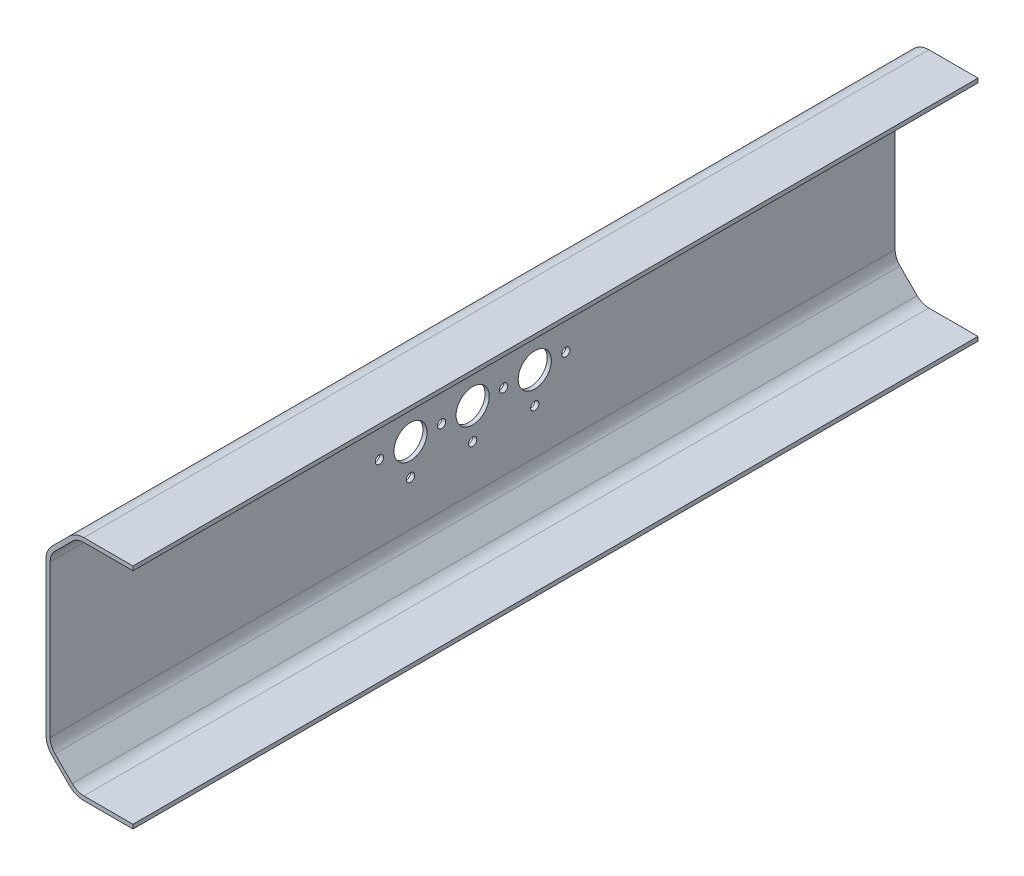
ISO-10303-21;
HEADER;
FILE_DESCRIPTION(('STEP AP214'),'2;1');
FILE_NAME('part.step','',(''),(''),'','','');
FILE_SCHEMA(('AUTOMOTIVE_DESIGN { 1 0 10303 214 1 1 1 1 }'));
ENDSEC;
DATA;
#1=APPLICATION_CONTEXT('core data for automotive mechanical design processes');
#2=APPLICATION_PROTOCOL_DEFINITION('international standard','automotive_design',2000,#1);
#3=PRODUCT_CONTEXT('',#1,'mechanical');
#4=PRODUCT('Part','Part','',(#3));
#5=PRODUCT_RELATED_PRODUCT_CATEGORY('part','',(#4));
#6=PRODUCT_DEFINITION_FORMATION('','',#4);
#7=PRODUCT_DEFINITION_CONTEXT('part definition',#1,'design');
#8=PRODUCT_DEFINITION('design','',#6,#7);
#9=PRODUCT_DEFINITION_SHAPE('','',#8);
#10=(LENGTH_UNIT() NAMED_UNIT(*) SI_UNIT(.MILLI.,.METRE.));
#11=(NAMED_UNIT(*) PLANE_ANGLE_UNIT() SI_UNIT($,.RADIAN.));
#12=(NAMED_UNIT(*) SI_UNIT($,.STERADIAN.) SOLID_ANGLE_UNIT());
#13=UNCERTAINTY_MEASURE_WITH_UNIT(LENGTH_MEASURE(1.E-05),#10,'distance_accuracy_value','');
#14=(GEOMETRIC_REPRESENTATION_CONTEXT(3) GLOBAL_UNCERTAINTY_ASSIGNED_CONTEXT((#13)) GLOBAL_UNIT_ASSIGNED_CONTEXT((#10,
#11,#12)) REPRESENTATION_CONTEXT('',''));
#15=CARTESIAN_POINT('',(0.,0.,0.));
#16=DIRECTION('',(0.,0.,1.));
#17=DIRECTION('',(1.,0.,0.));
#18=AXIS2_PLACEMENT_3D('',#15,#16,#17);
#19=CARTESIAN_POINT('',(13.9289321881345,55.,204.));
#20=DIRECTION('',(-1.,0.,0.));
#21=DIRECTION('',(0.,-1.,0.));
#22=AXIS2_PLACEMENT_3D('',#19,#20,#21);
#23=PLANE('',#22);
#24=DIRECTION('',(0.,1.,0.));
#25=VECTOR('',#24,1.);
#26=CARTESIAN_POINT('',(13.9289321881345,55.,0.));
#27=LINE('',#26,#25);
#28=CARTESIAN_POINT('',(13.9289321881345,54.,0.));
#29=VERTEX_POINT('',#28);
#30=CARTESIAN_POINT('',(13.9289321881345,55.,0.));
#31=VERTEX_POINT('',#30);
#32=EDGE_CURVE('E205',#29,#31,#27,.T.);
#33=ORIENTED_EDGE('',*,*,#32,.T.);
#34=DIRECTION('',(0.,0.,-1.));
#35=VECTOR('',#34,1.);
#36=CARTESIAN_POINT('',(13.9289321881345,55.,204.));
#37=LINE('',#36,#35);
#38=CARTESIAN_POINT('',(13.9289321881345,55.,204.));
#39=VERTEX_POINT('',#38);
#40=EDGE_CURVE('E11',#39,#31,#37,.T.);
#41=ORIENTED_EDGE('',*,*,#40,.F.);
#42=DIRECTION('',(0.,1.,0.));
#43=VECTOR('',#42,1.);
#44=CARTESIAN_POINT('',(13.9289321881345,55.,204.));
#45=LINE('',#44,#43);
#46=CARTESIAN_POINT('',(13.9289321881345,54.,204.));
#47=VERTEX_POINT('',#46);
#48=EDGE_CURVE('E243',#47,#39,#45,.T.);
#49=ORIENTED_EDGE('',*,*,#48,.F.);
#50=DIRECTION('',(0.,0.,-1.));
#51=VECTOR('',#50,1.);
#52=CARTESIAN_POINT('',(13.9289321881345,54.,204.));
#53=LINE('',#52,#51);
#54=EDGE_CURVE('E201',#47,#29,#53,.T.);
#55=ORIENTED_EDGE('',*,*,#54,.T.);
#56=EDGE_LOOP('',(#33,#41,#49,#55));
#57=FACE_BOUND('',#56,.T.);
#58=ADVANCED_FACE('F35',(#57),#23,.F.);
#59=CARTESIAN_POINT('',(2.07106781186545,55.,204.));
#60=DIRECTION('',(0.,-1.,0.));
#61=DIRECTION('',(0.,0.,-1.));
#62=AXIS2_PLACEMENT_3D('',#59,#60,#61);
#63=PLANE('',#62);
#64=DIRECTION('',(-1.,0.,0.));
#65=VECTOR('',#64,1.);
#66=CARTESIAN_POINT('',(2.07106781186545,55.,0.));
#67=LINE('',#66,#65);
#68=CARTESIAN_POINT('',(2.07106781186545,55.,0.));
#69=VERTEX_POINT('',#68);
#70=EDGE_CURVE('E208',#31,#69,#67,.T.);
#71=ORIENTED_EDGE('',*,*,#70,.T.);
#72=DIRECTION('',(0.,0.,-1.));
#73=VECTOR('',#72,1.);
#74=CARTESIAN_POINT('',(2.07106781186545,55.,204.));
#75=LINE('',#74,#73);
#76=CARTESIAN_POINT('',(2.07106781186545,55.,204.));
#77=VERTEX_POINT('',#76);
#78=EDGE_CURVE('E44',#77,#69,#75,.T.);
#79=ORIENTED_EDGE('',*,*,#78,.F.);
#80=DIRECTION('',(-1.,0.,0.));
#81=VECTOR('',#80,1.);
#82=CARTESIAN_POINT('',(2.07106781186545,55.,204.));
#83=LINE('',#82,#81);
#84=EDGE_CURVE('E132',#39,#77,#83,.T.);
#85=ORIENTED_EDGE('',*,*,#84,.F.);
#86=ORIENTED_EDGE('',*,*,#40,.T.);
#87=EDGE_LOOP('',(#71,#79,#85,#86));
#88=FACE_BOUND('',#87,.T.);
#89=ADVANCED_FACE('F347',(#88),#63,.F.);
#90=CARTESIAN_POINT('',(2.07106781186545,50.,204.));
#91=DIRECTION('',(0.,0.,-1.));
#92=DIRECTION('',(-1.,0.,0.));
#93=AXIS2_PLACEMENT_3D('',#90,#91,#92);
#94=CYLINDRICAL_SURFACE('',#93,5.);
#95=CARTESIAN_POINT('',(2.07106781186545,50.,0.));
#96=DIRECTION('',(0.,0.,1.));
#97=DIRECTION('',(-1.,0.,0.));
#98=AXIS2_PLACEMENT_3D('',#95,#96,#97);
#99=CIRCLE('',#98,5.);
#100=CARTESIAN_POINT('',(-1.46446609406728,53.5355339059328,0.));
#101=VERTEX_POINT('',#100);
#102=EDGE_CURVE('E210',#69,#101,#99,.T.);
#103=ORIENTED_EDGE('',*,*,#102,.T.);
#104=DIRECTION('',(0.,0.,-1.));
#105=VECTOR('',#104,1.);
#106=CARTESIAN_POINT('',(-1.46446609406728,53.5355339059328,204.));
#107=LINE('',#106,#105);
#108=CARTESIAN_POINT('',(-1.46446609406728,53.5355339059328,204.));
#109=VERTEX_POINT('',#108);
#110=EDGE_CURVE('E286',#109,#101,#107,.T.);
#111=ORIENTED_EDGE('',*,*,#110,.F.);
#112=CARTESIAN_POINT('',(2.07106781186545,50.,204.));
#113=DIRECTION('',(0.,0.,1.));
#114=DIRECTION('',(-1.,0.,0.));
#115=AXIS2_PLACEMENT_3D('',#112,#113,#114);
#116=CIRCLE('',#115,5.);
#117=EDGE_CURVE('E363',#77,#109,#116,.T.);
#118=ORIENTED_EDGE('',*,*,#117,.F.);
#119=ORIENTED_EDGE('',*,*,#78,.T.);
#120=EDGE_LOOP('',(#103,#111,#118,#119));
#121=FACE_BOUND('',#120,.T.);
#122=ADVANCED_FACE('F352',(#121),#94,.T.);
#123=CARTESIAN_POINT('',(-5.60660171779825,49.3933982822018,204.));
#124=DIRECTION('',(0.707106781186546,-0.707106781186549,0.));
#125=DIRECTION('',(0.707106781186549,0.707106781186546,0.));
#126=AXIS2_PLACEMENT_3D('',#123,#124,#125);
#127=PLANE('',#126);
#128=DIRECTION('',(-0.707106781186549,-0.707106781186546,0.));
#129=VECTOR('',#128,1.);
#130=CARTESIAN_POINT('',(-5.60660171779825,49.3933982822018,0.));
#131=LINE('',#130,#129);
#132=CARTESIAN_POINT('',(-5.60660171779825,49.3933982822018,0.));
#133=VERTEX_POINT('',#132);
#134=EDGE_CURVE('E212',#101,#133,#131,.T.);
#135=ORIENTED_EDGE('',*,*,#134,.T.);
#136=DIRECTION('',(0.,0.,-1.));
#137=VECTOR('',#136,1.);
#138=CARTESIAN_POINT('',(-5.60660171779825,49.3933982822018,204.));
#139=LINE('',#138,#137);
#140=CARTESIAN_POINT('',(-5.60660171779825,49.3933982822018,204.));
#141=VERTEX_POINT('',#140);
#142=EDGE_CURVE('E283',#141,#133,#139,.T.);
#143=ORIENTED_EDGE('',*,*,#142,.F.);
#144=DIRECTION('',(-0.707106781186549,-0.707106781186546,0.));
#145=VECTOR('',#144,1.);
#146=CARTESIAN_POINT('',(-5.60660171779825,49.3933982822018,204.));
#147=LINE('',#146,#145);
#148=EDGE_CURVE('E365',#109,#141,#147,.T.);
#149=ORIENTED_EDGE('',*,*,#148,.F.);
#150=ORIENTED_EDGE('',*,*,#110,.T.);
#151=EDGE_LOOP('',(#135,#143,#149,#150));
#152=FACE_BOUND('',#151,.T.);
#153=ADVANCED_FACE('F458',(#152),#127,.F.);
#154=CARTESIAN_POINT('',(-2.07106781186551,45.8578643762691,204.));
#155=DIRECTION('',(0.,0.,-1.));
#156=DIRECTION('',(-1.,0.,0.));
#157=AXIS2_PLACEMENT_3D('',#154,#155,#156);
#158=CYLINDRICAL_SURFACE('',#157,5.);
#159=CARTESIAN_POINT('',(-2.07106781186551,45.8578643762691,0.));
#160=DIRECTION('',(0.,0.,1.));
#161=DIRECTION('',(-1.,0.,0.));
#162=AXIS2_PLACEMENT_3D('',#159,#160,#161);
#163=CIRCLE('',#162,5.);
#164=CARTESIAN_POINT('',(-7.07106781186552,45.8578643762691,0.));
#165=VERTEX_POINT('',#164);
#166=EDGE_CURVE('E214',#133,#165,#163,.T.);
#167=ORIENTED_EDGE('',*,*,#166,.T.);
#168=DIRECTION('',(0.,0.,-1.));
#169=VECTOR('',#168,1.);
#170=CARTESIAN_POINT('',(-7.07106781186552,45.8578643762691,204.));
#171=LINE('',#170,#169);
#172=CARTESIAN_POINT('',(-7.07106781186552,45.8578643762691,204.));
#173=VERTEX_POINT('',#172);
#174=EDGE_CURVE('E280',#173,#165,#171,.T.);
#175=ORIENTED_EDGE('',*,*,#174,.F.);
#176=CARTESIAN_POINT('',(-2.07106781186551,45.8578643762691,204.));
#177=DIRECTION('',(0.,0.,1.));
#178=DIRECTION('',(-1.,0.,0.));
#179=AXIS2_PLACEMENT_3D('',#176,#177,#178);
#180=CIRCLE('',#179,5.);
#181=EDGE_CURVE('E367',#141,#173,#180,.T.);
#182=ORIENTED_EDGE('',*,*,#181,.F.);
#183=ORIENTED_EDGE('',*,*,#142,.T.);
#184=EDGE_LOOP('',(#167,#175,#182,#183));
#185=FACE_BOUND('',#184,.T.);
#186=ADVANCED_FACE('F455',(#185),#158,.T.);
#187=CARTESIAN_POINT('',(-7.07106781186551,9.14213562373095,204.));
#188=DIRECTION('',(1.,0.,0.));
#189=DIRECTION('',(0.,1.,0.));
#190=AXIS2_PLACEMENT_3D('',#187,#188,#189);
#191=PLANE('',#190);
#192=CARTESIAN_POINT('',(-7.07106781186551,27.4999999999999,87.));
#193=DIRECTION('',(-1.,0.,0.));
#194=DIRECTION('',(0.,0.,1.));
#195=AXIS2_PLACEMENT_3D('',#192,#193,#194);
#196=CIRCLE('',#195,4.00000000000001);
#197=CARTESIAN_POINT('',(-7.07106781186551,27.4999999999999,91.));
#198=VERTEX_POINT('',#197);
#199=EDGE_CURVE('E529',#198,#198,#196,.T.);
#200=ORIENTED_EDGE('',*,*,#199,.F.);
#201=EDGE_LOOP('',(#200));
#202=FACE_BOUND('',#201,.T.);
#203=CARTESIAN_POINT('',(-7.07106781186551,34.9999999999999,87.));
#204=DIRECTION('',(-1.,0.,0.));
#205=DIRECTION('',(0.,0.,1.));
#206=AXIS2_PLACEMENT_3D('',#203,#204,#205);
#207=CIRCLE('',#206,0.999999999999998);
#208=CARTESIAN_POINT('',(-7.07106781186551,34.9999999999999,88.));
#209=VERTEX_POINT('',#208);
#210=EDGE_CURVE('E526',#209,#209,#207,.T.);
#211=ORIENTED_EDGE('',*,*,#210,.F.);
#212=EDGE_LOOP('',(#211));
#213=FACE_BOUND('',#212,.T.);
#214=CARTESIAN_POINT('',(-7.07106781186551,19.9999999999999,87.));
#215=DIRECTION('',(-1.,0.,0.));
#216=DIRECTION('',(0.,0.,1.));
#217=AXIS2_PLACEMENT_3D('',#214,#215,#216);
#218=CIRCLE('',#217,0.999999999999998);
#219=CARTESIAN_POINT('',(-7.07106781186551,19.9999999999999,88.));
#220=VERTEX_POINT('',#219);
#221=EDGE_CURVE('E530',#220,#220,#218,.T.);
#222=ORIENTED_EDGE('',*,*,#221,.F.);
#223=EDGE_LOOP('',(#222));
#224=FACE_BOUND('',#223,.T.);
#225=CARTESIAN_POINT('',(-7.07106781186551,27.4999999999999,79.5));
#226=DIRECTION('',(-1.,0.,0.));
#227=DIRECTION('',(0.,0.,1.));
#228=AXIS2_PLACEMENT_3D('',#225,#226,#227);
#229=CIRCLE('',#228,0.999999999999998);
#230=CARTESIAN_POINT('',(-7.07106781186551,27.4999999999999,80.5));
#231=VERTEX_POINT('',#230);
#232=EDGE_CURVE('E533',#231,#231,#229,.T.);
#233=ORIENTED_EDGE('',*,*,#232,.F.);
#234=EDGE_LOOP('',(#233));
#235=FACE_BOUND('',#234,.T.);
#236=CARTESIAN_POINT('',(-7.07106781186551,20.,102.));
#237=DIRECTION('',(-1.,0.,0.));
#238=DIRECTION('',(0.,0.,1.));
#239=AXIS2_PLACEMENT_3D('',#236,#237,#238);
#240=CIRCLE('',#239,1.00000000000001);
#241=CARTESIAN_POINT('',(-7.07106781186551,20.,103.));
#242=VERTEX_POINT('',#241);
#243=EDGE_CURVE('E541',#242,#242,#240,.T.);
#244=ORIENTED_EDGE('',*,*,#243,.F.);
#245=EDGE_LOOP('',(#244));
#246=FACE_BOUND('',#245,.T.);
#247=CARTESIAN_POINT('',(-7.07106781186551,27.5,109.5));
#248=DIRECTION('',(-1.,0.,0.));
#249=DIRECTION('',(0.,0.,1.));
#250=AXIS2_PLACEMENT_3D('',#247,#248,#249);
#251=CIRCLE('',#250,0.999999999999998);
#252=CARTESIAN_POINT('',(-7.07106781186551,27.5,110.5));
#253=VERTEX_POINT('',#252);
#254=EDGE_CURVE('E539',#253,#253,#251,.T.);
#255=ORIENTED_EDGE('',*,*,#254,.F.);
#256=EDGE_LOOP('',(#255));
#257=FACE_BOUND('',#256,.T.);
#258=CARTESIAN_POINT('',(-7.07106781186551,27.5,117.));
#259=DIRECTION('',(-1.,0.,0.));
#260=DIRECTION('',(0.,0.,1.));
#261=AXIS2_PLACEMENT_3D('',#258,#259,#260);
#262=CIRCLE('',#261,4.00000000000001);
#263=CARTESIAN_POINT('',(-7.07106781186551,27.5,121.));
#264=VERTEX_POINT('',#263);
#265=EDGE_CURVE('E523',#264,#264,#262,.T.);
#266=ORIENTED_EDGE('',*,*,#265,.F.);
#267=EDGE_LOOP('',(#266));
#268=FACE_BOUND('',#267,.T.);
#269=CARTESIAN_POINT('',(-7.07106781186551,35.,102.));
#270=DIRECTION('',(-1.,0.,0.));
#271=DIRECTION('',(0.,0.,1.));
#272=AXIS2_PLACEMENT_3D('',#269,#270,#271);
#273=CIRCLE('',#272,0.999999999999998);
#274=CARTESIAN_POINT('',(-7.07106781186551,35.,103.));
#275=VERTEX_POINT('',#274);
#276=EDGE_CURVE('E520',#275,#275,#273,.T.);
#277=ORIENTED_EDGE('',*,*,#276,.F.);
#278=EDGE_LOOP('',(#277));
#279=FACE_BOUND('',#278,.T.);
#280=CARTESIAN_POINT('',(-7.07106781186551,20.,117.));
#281=DIRECTION('',(-1.,0.,0.));
#282=DIRECTION('',(0.,0.,1.));
#283=AXIS2_PLACEMENT_3D('',#280,#281,#282);
#284=CIRCLE('',#283,0.999999999999998);
#285=CARTESIAN_POINT('',(-7.07106781186551,20.,118.));
#286=VERTEX_POINT('',#285);
#287=EDGE_CURVE('E532',#286,#286,#284,.T.);
#288=ORIENTED_EDGE('',*,*,#287,.F.);
#289=EDGE_LOOP('',(#288));
#290=FACE_BOUND('',#289,.T.);
#291=CARTESIAN_POINT('',(-7.07106781186551,27.5,124.5));
#292=DIRECTION('',(-1.,0.,0.));
#293=DIRECTION('',(0.,0.,1.));
#294=AXIS2_PLACEMENT_3D('',#291,#292,#293);
#295=CIRCLE('',#294,0.999999999999984);
#296=CARTESIAN_POINT('',(-7.07106781186551,27.5,125.5));
#297=VERTEX_POINT('',#296);
#298=EDGE_CURVE('E550',#297,#297,#295,.T.);
#299=ORIENTED_EDGE('',*,*,#298,.F.);
#300=EDGE_LOOP('',(#299));
#301=FACE_BOUND('',#300,.T.);
#302=CARTESIAN_POINT('',(-7.07106781186551,35.,117.));
#303=DIRECTION('',(-1.,0.,0.));
#304=DIRECTION('',(0.,0.,1.));
#305=AXIS2_PLACEMENT_3D('',#302,#303,#304);
#306=CIRCLE('',#305,0.999999999999998);
#307=CARTESIAN_POINT('',(-7.07106781186551,35.,118.));
#308=VERTEX_POINT('',#307);
#309=EDGE_CURVE('E547',#308,#308,#306,.T.);
#310=ORIENTED_EDGE('',*,*,#309,.F.);
#311=EDGE_LOOP('',(#310));
#312=FACE_BOUND('',#311,.T.);
#313=CARTESIAN_POINT('',(-7.07106781186551,27.5,94.5));
#314=DIRECTION('',(-1.,0.,0.));
#315=DIRECTION('',(0.,0.,1.));
#316=AXIS2_PLACEMENT_3D('',#313,#314,#315);
#317=CIRCLE('',#316,0.999999999999998);
#318=CARTESIAN_POINT('',(-7.07106781186551,27.5,95.5));
#319=VERTEX_POINT('',#318);
#320=EDGE_CURVE('E544',#319,#319,#317,.T.);
#321=ORIENTED_EDGE('',*,*,#320,.F.);
#322=EDGE_LOOP('',(#321));
#323=FACE_BOUND('',#322,.T.);
#324=CARTESIAN_POINT('',(-7.07106781186551,27.5,102.));
#325=DIRECTION('',(-1.,0.,0.));
#326=DIRECTION('',(0.,0.,1.));
#327=AXIS2_PLACEMENT_3D('',#324,#325,#326);
#328=CIRCLE('',#327,4.00000000000001);
#329=CARTESIAN_POINT('',(-7.07106781186551,27.5,106.));
#330=VERTEX_POINT('',#329);
#331=EDGE_CURVE('E295',#330,#330,#328,.T.);
#332=ORIENTED_EDGE('',*,*,#331,.F.);
#333=EDGE_LOOP('',(#332));
#334=FACE_BOUND('',#333,.T.);
#335=DIRECTION('',(0.,-1.,0.));
#336=VECTOR('',#335,1.);
#337=CARTESIAN_POINT('',(-7.07106781186551,9.14213562373095,0.));
#338=LINE('',#337,#336);
#339=CARTESIAN_POINT('',(-7.07106781186551,9.14213562373095,0.));
#340=VERTEX_POINT('',#339);
#341=EDGE_CURVE('E216',#165,#340,#338,.T.);
#342=ORIENTED_EDGE('',*,*,#341,.T.);
#343=DIRECTION('',(0.,0.,-1.));
#344=VECTOR('',#343,1.);
#345=CARTESIAN_POINT('',(-7.07106781186551,9.14213562373095,204.));
#346=LINE('',#345,#344);
#347=CARTESIAN_POINT('',(-7.07106781186551,9.14213562373095,204.));
#348=VERTEX_POINT('',#347);
#349=EDGE_CURVE('E277',#348,#340,#346,.T.);
#350=ORIENTED_EDGE('',*,*,#349,.F.);
#351=DIRECTION('',(0.,-1.,0.));
#352=VECTOR('',#351,1.);
#353=CARTESIAN_POINT('',(-7.07106781186551,9.14213562373095,204.));
#354=LINE('',#353,#352);
#355=EDGE_CURVE('E373',#173,#348,#354,.T.);
#356=ORIENTED_EDGE('',*,*,#355,.F.);
#357=ORIENTED_EDGE('',*,*,#174,.T.);
#358=EDGE_LOOP('',(#342,#350,#356,#357));
#359=FACE_BOUND('',#358,.T.);
#360=ADVANCED_FACE('F450',(#202,#213,#224,#235,#246,#257,#268,#279,#290,#301,#312,#323,#334,
#359),#191,.F.);
#361=CARTESIAN_POINT('',(-2.07106781186554,9.14213562373094,204.));
#362=DIRECTION('',(0.,0.,-1.));
#363=DIRECTION('',(-1.,0.,0.));
#364=AXIS2_PLACEMENT_3D('',#361,#362,#363);
#365=CYLINDRICAL_SURFACE('',#364,4.99999999999999);
#366=CARTESIAN_POINT('',(-2.07106781186554,9.14213562373094,0.));
#367=DIRECTION('',(0.,0.,1.));
#368=DIRECTION('',(-1.,0.,0.));
#369=AXIS2_PLACEMENT_3D('',#366,#367,#368);
#370=CIRCLE('',#369,4.99999999999999);
#371=CARTESIAN_POINT('',(-5.60660171779825,5.60660171779819,0.));
#372=VERTEX_POINT('',#371);
#373=EDGE_CURVE('E218',#340,#372,#370,.T.);
#374=ORIENTED_EDGE('',*,*,#373,.T.);
#375=DIRECTION('',(0.,0.,-1.));
#376=VECTOR('',#375,1.);
#377=CARTESIAN_POINT('',(-5.60660171779825,5.60660171779819,204.));
#378=LINE('',#377,#376);
#379=CARTESIAN_POINT('',(-5.60660171779825,5.60660171779819,204.));
#380=VERTEX_POINT('',#379);
#381=EDGE_CURVE('E274',#380,#372,#378,.T.);
#382=ORIENTED_EDGE('',*,*,#381,.F.);
#383=CARTESIAN_POINT('',(-2.07106781186554,9.14213562373094,204.));
#384=DIRECTION('',(0.,0.,1.));
#385=DIRECTION('',(-1.,0.,0.));
#386=AXIS2_PLACEMENT_3D('',#383,#384,#385);
#387=CIRCLE('',#386,4.99999999999999);
#388=EDGE_CURVE('E375',#348,#380,#387,.T.);
#389=ORIENTED_EDGE('',*,*,#388,.F.);
#390=ORIENTED_EDGE('',*,*,#349,.T.);
#391=EDGE_LOOP('',(#374,#382,#389,#390));
#392=FACE_BOUND('',#391,.T.);
#393=ADVANCED_FACE('F445',(#392),#365,.T.);
#394=CARTESIAN_POINT('',(-1.46446609406727,1.46446609406724,204.));
#395=DIRECTION('',(0.707106781186544,0.707106781186552,0.));
#396=DIRECTION('',(-0.707106781186552,0.707106781186544,0.));
#397=AXIS2_PLACEMENT_3D('',#394,#395,#396);
#398=PLANE('',#397);
#399=DIRECTION('',(0.707106781186552,-0.707106781186544,0.));
#400=VECTOR('',#399,1.);
#401=CARTESIAN_POINT('',(-1.46446609406727,1.46446609406724,0.));
#402=LINE('',#401,#400);
#403=CARTESIAN_POINT('',(-1.46446609406727,1.46446609406724,0.));
#404=VERTEX_POINT('',#403);
#405=EDGE_CURVE('E220',#372,#404,#402,.T.);
#406=ORIENTED_EDGE('',*,*,#405,.T.);
#407=DIRECTION('',(0.,0.,-1.));
#408=VECTOR('',#407,1.);
#409=CARTESIAN_POINT('',(-1.46446609406727,1.46446609406724,204.));
#410=LINE('',#409,#408);
#411=CARTESIAN_POINT('',(-1.46446609406727,1.46446609406724,204.));
#412=VERTEX_POINT('',#411);
#413=EDGE_CURVE('E271',#412,#404,#410,.T.);
#414=ORIENTED_EDGE('',*,*,#413,.F.);
#415=DIRECTION('',(0.707106781186552,-0.707106781186544,0.));
#416=VECTOR('',#415,1.);
#417=CARTESIAN_POINT('',(-1.46446609406727,1.46446609406724,204.));
#418=LINE('',#417,#416);
#419=EDGE_CURVE('E377',#380,#412,#418,.T.);
#420=ORIENTED_EDGE('',*,*,#419,.F.);
#421=ORIENTED_EDGE('',*,*,#381,.T.);
#422=EDGE_LOOP('',(#406,#414,#420,#421));
#423=FACE_BOUND('',#422,.T.);
#424=ADVANCED_FACE('F441',(#423),#398,.F.);
#425=CARTESIAN_POINT('',(2.07106781186546,5.,204.));
#426=DIRECTION('',(0.,0.,-1.));
#427=DIRECTION('',(-1.,0.,0.));
#428=AXIS2_PLACEMENT_3D('',#425,#426,#427);
#429=CYLINDRICAL_SURFACE('',#428,5.00000000000001);
#430=CARTESIAN_POINT('',(2.07106781186546,5.,0.));
#431=DIRECTION('',(0.,0.,1.));
#432=DIRECTION('',(1.,0.,0.));
#433=AXIS2_PLACEMENT_3D('',#430,#431,#432);
#434=CIRCLE('',#433,5.00000000000001);
#435=CARTESIAN_POINT('',(2.07106781186544,0.,0.));
#436=VERTEX_POINT('',#435);
#437=EDGE_CURVE('E222',#404,#436,#434,.T.);
#438=ORIENTED_EDGE('',*,*,#437,.T.);
#439=DIRECTION('',(0.,0.,-1.));
#440=VECTOR('',#439,1.);
#441=CARTESIAN_POINT('',(2.07106781186544,0.,204.));
#442=LINE('',#441,#440);
#443=CARTESIAN_POINT('',(2.07106781186544,0.,204.));
#444=VERTEX_POINT('',#443);
#445=EDGE_CURVE('E268',#444,#436,#442,.T.);
#446=ORIENTED_EDGE('',*,*,#445,.F.);
#447=CARTESIAN_POINT('',(2.07106781186546,5.,204.));
#448=DIRECTION('',(0.,0.,1.));
#449=DIRECTION('',(1.,0.,0.));
#450=AXIS2_PLACEMENT_3D('',#447,#448,#449);
#451=CIRCLE('',#450,5.00000000000001);
#452=EDGE_CURVE('E379',#412,#444,#451,.T.);
#453=ORIENTED_EDGE('',*,*,#452,.F.);
#454=ORIENTED_EDGE('',*,*,#413,.T.);
#455=EDGE_LOOP('',(#438,#446,#453,#454));
#456=FACE_BOUND('',#455,.T.);
#457=ADVANCED_FACE('F436',(#456),#429,.T.);
#458=CARTESIAN_POINT('',(13.9289321881345,0.,204.));
#459=DIRECTION('',(0.,1.,0.));
#460=DIRECTION('',(-1.,0.,0.));
#461=AXIS2_PLACEMENT_3D('',#458,#459,#460);
#462=PLANE('',#461);
#463=DIRECTION('',(1.,0.,0.));
#464=VECTOR('',#463,1.);
#465=CARTESIAN_POINT('',(13.9289321881345,0.,0.));
#466=LINE('',#465,#464);
#467=CARTESIAN_POINT('',(13.9289321881345,0.,0.));
#468=VERTEX_POINT('',#467);
#469=EDGE_CURVE('E224',#436,#468,#466,.T.);
#470=ORIENTED_EDGE('',*,*,#469,.T.);
#471=DIRECTION('',(0.,0.,-1.));
#472=VECTOR('',#471,1.);
#473=CARTESIAN_POINT('',(13.9289321881345,0.,204.));
#474=LINE('',#473,#472);
#475=CARTESIAN_POINT('',(13.9289321881345,0.,204.));
#476=VERTEX_POINT('',#475);
#477=EDGE_CURVE('E265',#476,#468,#474,.T.);
#478=ORIENTED_EDGE('',*,*,#477,.F.);
#479=DIRECTION('',(1.,0.,0.));
#480=VECTOR('',#479,1.);
#481=CARTESIAN_POINT('',(13.9289321881345,0.,204.));
#482=LINE('',#481,#480);
#483=EDGE_CURVE('E381',#444,#476,#482,.T.);
#484=ORIENTED_EDGE('',*,*,#483,.F.);
#485=ORIENTED_EDGE('',*,*,#445,.T.);
#486=EDGE_LOOP('',(#470,#478,#484,#485));
#487=FACE_BOUND('',#486,.T.);
#488=ADVANCED_FACE('F430',(#487),#462,.F.);
#489=CARTESIAN_POINT('',(13.9289321881345,0.,204.));
#490=DIRECTION('',(-1.,0.,0.));
#491=DIRECTION('',(0.,0.,1.));
#492=AXIS2_PLACEMENT_3D('',#489,#490,#491);
#493=PLANE('',#492);
#494=DIRECTION('',(0.,1.,0.));
#495=VECTOR('',#494,1.);
#496=CARTESIAN_POINT('',(13.9289321881345,0.,0.));
#497=LINE('',#496,#495);
#498=CARTESIAN_POINT('',(13.9289321881345,1.,0.));
#499=VERTEX_POINT('',#498);
#500=EDGE_CURVE('E226',#468,#499,#497,.T.);
#501=ORIENTED_EDGE('',*,*,#500,.T.);
#502=DIRECTION('',(0.,0.,-1.));
#503=VECTOR('',#502,1.);
#504=CARTESIAN_POINT('',(13.9289321881345,1.,204.));
#505=LINE('',#504,#503);
#506=CARTESIAN_POINT('',(13.9289321881345,1.,204.));
#507=VERTEX_POINT('',#506);
#508=EDGE_CURVE('E262',#507,#499,#505,.T.);
#509=ORIENTED_EDGE('',*,*,#508,.F.);
#510=DIRECTION('',(0.,1.,0.));
#511=VECTOR('',#510,1.);
#512=CARTESIAN_POINT('',(13.9289321881345,0.,204.));
#513=LINE('',#512,#511);
#514=EDGE_CURVE('E383',#476,#507,#513,.T.);
#515=ORIENTED_EDGE('',*,*,#514,.F.);
#516=ORIENTED_EDGE('',*,*,#477,.T.);
#517=EDGE_LOOP('',(#501,#509,#515,#516));
#518=FACE_BOUND('',#517,.T.);
#519=ADVANCED_FACE('F426',(#518),#493,.F.);
#520=CARTESIAN_POINT('',(13.9289321881345,1.,204.));
#521=DIRECTION('',(0.,-1.,0.));
#522=DIRECTION('',(1.,0.,0.));
#523=AXIS2_PLACEMENT_3D('',#520,#521,#522);
#524=PLANE('',#523);
#525=DIRECTION('',(-1.,0.,0.));
#526=VECTOR('',#525,1.);
#527=CARTESIAN_POINT('',(13.9289321881345,1.,0.));
#528=LINE('',#527,#526);
#529=CARTESIAN_POINT('',(2.07106781186544,1.,0.));
#530=VERTEX_POINT('',#529);
#531=EDGE_CURVE('E228',#499,#530,#528,.T.);
#532=ORIENTED_EDGE('',*,*,#531,.T.);
#533=DIRECTION('',(0.,0.,-1.));
#534=VECTOR('',#533,1.);
#535=CARTESIAN_POINT('',(2.07106781186544,1.,204.));
#536=LINE('',#535,#534);
#537=CARTESIAN_POINT('',(2.07106781186544,1.,204.));
#538=VERTEX_POINT('',#537);
#539=EDGE_CURVE('E259',#538,#530,#536,.T.);
#540=ORIENTED_EDGE('',*,*,#539,.F.);
#541=DIRECTION('',(-1.,0.,0.));
#542=VECTOR('',#541,1.);
#543=CARTESIAN_POINT('',(13.9289321881345,1.,204.));
#544=LINE('',#543,#542);
#545=EDGE_CURVE('E385',#507,#538,#544,.T.);
#546=ORIENTED_EDGE('',*,*,#545,.F.);
#547=ORIENTED_EDGE('',*,*,#508,.T.);
#548=EDGE_LOOP('',(#532,#540,#546,#547));
#549=FACE_BOUND('',#548,.T.);
#550=ADVANCED_FACE('F421',(#549),#524,.F.);
#551=CARTESIAN_POINT('',(2.07106781186544,5.,204.));
#552=DIRECTION('',(0.,0.,-1.));
#553=DIRECTION('',(-1.,0.,0.));
#554=AXIS2_PLACEMENT_3D('',#551,#552,#553);
#555=CYLINDRICAL_SURFACE('',#554,4.);
#556=CARTESIAN_POINT('',(2.07106781186544,5.,0.));
#557=DIRECTION('',(0.,0.,-1.));
#558=DIRECTION('',(1.,0.,0.));
#559=AXIS2_PLACEMENT_3D('',#556,#557,#558);
#560=CIRCLE('',#559,4.);
#561=CARTESIAN_POINT('',(-0.75735931288073,2.17157287525379,0.));
#562=VERTEX_POINT('',#561);
#563=EDGE_CURVE('E230',#530,#562,#560,.T.);
#564=ORIENTED_EDGE('',*,*,#563,.T.);
#565=DIRECTION('',(0.,0.,-1.));
#566=VECTOR('',#565,1.);
#567=CARTESIAN_POINT('',(-0.75735931288073,2.17157287525379,204.));
#568=LINE('',#567,#566);
#569=CARTESIAN_POINT('',(-0.75735931288073,2.17157287525379,204.));
#570=VERTEX_POINT('',#569);
#571=EDGE_CURVE('E256',#570,#562,#568,.T.);
#572=ORIENTED_EDGE('',*,*,#571,.F.);
#573=CARTESIAN_POINT('',(2.07106781186544,5.,204.));
#574=DIRECTION('',(0.,0.,-1.));
#575=DIRECTION('',(1.,0.,0.));
#576=AXIS2_PLACEMENT_3D('',#573,#574,#575);
#577=CIRCLE('',#576,4.);
#578=EDGE_CURVE('E387',#538,#570,#577,.T.);
#579=ORIENTED_EDGE('',*,*,#578,.F.);
#580=ORIENTED_EDGE('',*,*,#539,.T.);
#581=EDGE_LOOP('',(#564,#572,#579,#580));
#582=FACE_BOUND('',#581,.T.);
#583=ADVANCED_FACE('F415',(#582),#555,.F.);
#584=CARTESIAN_POINT('',(-0.75735931288073,2.17157287525379,204.));
#585=DIRECTION('',(-0.707106781186544,-0.707106781186551,0.));
#586=DIRECTION('',(0.707106781186551,-0.707106781186544,0.));
#587=AXIS2_PLACEMENT_3D('',#584,#585,#586);
#588=PLANE('',#587);
#589=DIRECTION('',(-0.707106781186551,0.707106781186544,0.));
#590=VECTOR('',#589,1.);
#591=CARTESIAN_POINT('',(-0.75735931288073,2.17157287525379,0.));
#592=LINE('',#591,#590);
#593=CARTESIAN_POINT('',(-4.89949493661172,6.31370849898473,0.));
#594=VERTEX_POINT('',#593);
#595=EDGE_CURVE('E232',#562,#594,#592,.T.);
#596=ORIENTED_EDGE('',*,*,#595,.T.);
#597=DIRECTION('',(0.,0.,-1.));
#598=VECTOR('',#597,1.);
#599=CARTESIAN_POINT('',(-4.89949493661172,6.31370849898473,204.));
#600=LINE('',#599,#598);
#601=CARTESIAN_POINT('',(-4.89949493661172,6.31370849898473,204.));
#602=VERTEX_POINT('',#601);
#603=EDGE_CURVE('E253',#602,#594,#600,.T.);
#604=ORIENTED_EDGE('',*,*,#603,.F.);
#605=DIRECTION('',(-0.707106781186551,0.707106781186544,0.));
#606=VECTOR('',#605,1.);
#607=CARTESIAN_POINT('',(-0.75735931288073,2.17157287525379,204.));
#608=LINE('',#607,#606);
#609=EDGE_CURVE('E389',#570,#602,#608,.T.);
#610=ORIENTED_EDGE('',*,*,#609,.F.);
#611=ORIENTED_EDGE('',*,*,#571,.T.);
#612=EDGE_LOOP('',(#596,#604,#610,#611));
#613=FACE_BOUND('',#612,.T.);
#614=ADVANCED_FACE('F411',(#613),#588,.F.);
#615=CARTESIAN_POINT('',(-2.07106781186551,9.14213562373093,204.));
#616=DIRECTION('',(0.,0.,-1.));
#617=DIRECTION('',(-1.,0.,0.));
#618=AXIS2_PLACEMENT_3D('',#615,#616,#617);
#619=CYLINDRICAL_SURFACE('',#618,4.00000000000001);
#620=CARTESIAN_POINT('',(-2.07106781186551,9.14213562373093,0.));
#621=DIRECTION('',(0.,0.,-1.));
#622=DIRECTION('',(-1.,0.,0.));
#623=AXIS2_PLACEMENT_3D('',#620,#621,#622);
#624=CIRCLE('',#623,4.00000000000001);
#625=CARTESIAN_POINT('',(-6.07106781186552,9.14213562373093,0.));
#626=VERTEX_POINT('',#625);
#627=EDGE_CURVE('E234',#594,#626,#624,.T.);
#628=ORIENTED_EDGE('',*,*,#627,.T.);
#629=DIRECTION('',(0.,0.,-1.));
#630=VECTOR('',#629,1.);
#631=CARTESIAN_POINT('',(-6.07106781186552,9.14213562373093,204.));
#632=LINE('',#631,#630);
#633=CARTESIAN_POINT('',(-6.07106781186552,9.14213562373093,204.));
#634=VERTEX_POINT('',#633);
#635=EDGE_CURVE('E250',#634,#626,#632,.T.);
#636=ORIENTED_EDGE('',*,*,#635,.F.);
#637=CARTESIAN_POINT('',(-2.07106781186551,9.14213562373093,204.));
#638=DIRECTION('',(0.,0.,-1.));
#639=DIRECTION('',(-1.,0.,0.));
#640=AXIS2_PLACEMENT_3D('',#637,#638,#639);
#641=CIRCLE('',#640,4.00000000000001);
#642=EDGE_CURVE('E391',#602,#634,#641,.T.);
#643=ORIENTED_EDGE('',*,*,#642,.F.);
#644=ORIENTED_EDGE('',*,*,#603,.T.);
#645=EDGE_LOOP('',(#628,#636,#643,#644));
#646=FACE_BOUND('',#645,.T.);
#647=ADVANCED_FACE('F407',(#646),#619,.F.);
#648=CARTESIAN_POINT('',(-6.07106781186551,9.14213562373094,204.));
#649=DIRECTION('',(-1.,0.,0.));
#650=DIRECTION('',(0.,-1.,0.));
#651=AXIS2_PLACEMENT_3D('',#648,#649,#650);
#652=PLANE('',#651);
#653=CARTESIAN_POINT('',(-6.07106781186552,27.4999999999999,87.));
#654=DIRECTION('',(-1.,0.,0.));
#655=DIRECTION('',(0.,-1.,0.));
#656=AXIS2_PLACEMENT_3D('',#653,#654,#655);
#657=CIRCLE('',#656,4.00000000000001);
#658=CARTESIAN_POINT('',(-6.07106781186552,23.4999999999999,87.));
#659=VERTEX_POINT('',#658);
#660=EDGE_CURVE('E38',#659,#659,#657,.T.);
#661=ORIENTED_EDGE('',*,*,#660,.T.);
#662=EDGE_LOOP('',(#661));
#663=FACE_BOUND('',#662,.T.);
#664=CARTESIAN_POINT('',(-6.07106781186552,34.9999999999999,87.));
#665=DIRECTION('',(-1.,0.,0.));
#666=DIRECTION('',(0.,-1.,0.));
#667=AXIS2_PLACEMENT_3D('',#664,#665,#666);
#668=CIRCLE('',#667,0.999999999999998);
#669=CARTESIAN_POINT('',(-6.07106781186552,33.9999999999999,87.));
#670=VERTEX_POINT('',#669);
#671=EDGE_CURVE('E324',#670,#670,#668,.T.);
#672=ORIENTED_EDGE('',*,*,#671,.T.);
#673=EDGE_LOOP('',(#672));
#674=FACE_BOUND('',#673,.T.);
#675=CARTESIAN_POINT('',(-6.07106781186552,19.9999999999999,87.));
#676=DIRECTION('',(-1.,0.,0.));
#677=DIRECTION('',(0.,-1.,0.));
#678=AXIS2_PLACEMENT_3D('',#675,#676,#677);
#679=CIRCLE('',#678,0.999999999999998);
#680=CARTESIAN_POINT('',(-6.07106781186552,18.9999999999999,87.));
#681=VERTEX_POINT('',#680);
#682=EDGE_CURVE('E322',#681,#681,#679,.T.);
#683=ORIENTED_EDGE('',*,*,#682,.T.);
#684=EDGE_LOOP('',(#683));
#685=FACE_BOUND('',#684,.T.);
#686=CARTESIAN_POINT('',(-6.07106781186552,27.4999999999999,79.5));
#687=DIRECTION('',(-1.,0.,0.));
#688=DIRECTION('',(0.,-1.,0.));
#689=AXIS2_PLACEMENT_3D('',#686,#687,#688);
#690=CIRCLE('',#689,0.999999999999998);
#691=CARTESIAN_POINT('',(-6.07106781186552,26.4999999999999,79.5));
#692=VERTEX_POINT('',#691);
#693=EDGE_CURVE('E319',#692,#692,#690,.T.);
#694=ORIENTED_EDGE('',*,*,#693,.T.);
#695=EDGE_LOOP('',(#694));
#696=FACE_BOUND('',#695,.T.);
#697=CARTESIAN_POINT('',(-6.07106781186552,20.,102.));
#698=DIRECTION('',(-1.,0.,0.));
#699=DIRECTION('',(0.,-1.,0.));
#700=AXIS2_PLACEMENT_3D('',#697,#698,#699);
#701=CIRCLE('',#700,1.00000000000001);
#702=CARTESIAN_POINT('',(-6.07106781186552,19.,102.));
#703=VERTEX_POINT('',#702);
#704=EDGE_CURVE('E316',#703,#703,#701,.T.);
#705=ORIENTED_EDGE('',*,*,#704,.T.);
#706=EDGE_LOOP('',(#705));
#707=FACE_BOUND('',#706,.T.);
#708=CARTESIAN_POINT('',(-6.07106781186552,27.5,109.5));
#709=DIRECTION('',(-1.,0.,0.));
#710=DIRECTION('',(0.,-1.,0.));
#711=AXIS2_PLACEMENT_3D('',#708,#709,#710);
#712=CIRCLE('',#711,0.999999999999998);
#713=CARTESIAN_POINT('',(-6.07106781186552,26.5,109.5));
#714=VERTEX_POINT('',#713);
#715=EDGE_CURVE('E313',#714,#714,#712,.T.);
#716=ORIENTED_EDGE('',*,*,#715,.T.);
#717=EDGE_LOOP('',(#716));
#718=FACE_BOUND('',#717,.T.);
#719=CARTESIAN_POINT('',(-6.07106781186552,27.5,117.));
#720=DIRECTION('',(-1.,0.,0.));
#721=DIRECTION('',(0.,-1.,0.));
#722=AXIS2_PLACEMENT_3D('',#719,#720,#721);
#723=CIRCLE('',#722,4.00000000000001);
#724=CARTESIAN_POINT('',(-6.07106781186552,23.5,117.));
#725=VERTEX_POINT('',#724);
#726=EDGE_CURVE('E310',#725,#725,#723,.T.);
#727=ORIENTED_EDGE('',*,*,#726,.T.);
#728=EDGE_LOOP('',(#727));
#729=FACE_BOUND('',#728,.T.);
#730=CARTESIAN_POINT('',(-6.07106781186552,35.,102.));
#731=DIRECTION('',(-1.,0.,0.));
#732=DIRECTION('',(0.,-1.,0.));
#733=AXIS2_PLACEMENT_3D('',#730,#731,#732);
#734=CIRCLE('',#733,0.999999999999998);
#735=CARTESIAN_POINT('',(-6.07106781186552,34.,102.));
#736=VERTEX_POINT('',#735);
#737=EDGE_CURVE('E307',#736,#736,#734,.T.);
#738=ORIENTED_EDGE('',*,*,#737,.T.);
#739=EDGE_LOOP('',(#738));
#740=FACE_BOUND('',#739,.T.);
#741=CARTESIAN_POINT('',(-6.07106781186552,20.,117.));
#742=DIRECTION('',(-1.,0.,0.));
#743=DIRECTION('',(0.,-1.,0.));
#744=AXIS2_PLACEMENT_3D('',#741,#742,#743);
#745=CIRCLE('',#744,0.999999999999998);
#746=CARTESIAN_POINT('',(-6.07106781186552,19.,117.));
#747=VERTEX_POINT('',#746);
#748=EDGE_CURVE('E304',#747,#747,#745,.T.);
#749=ORIENTED_EDGE('',*,*,#748,.T.);
#750=EDGE_LOOP('',(#749));
#751=FACE_BOUND('',#750,.T.);
#752=CARTESIAN_POINT('',(-6.07106781186552,27.5,124.5));
#753=DIRECTION('',(-1.,0.,0.));
#754=DIRECTION('',(0.,-1.,0.));
#755=AXIS2_PLACEMENT_3D('',#752,#753,#754);
#756=CIRCLE('',#755,0.999999999999984);
#757=CARTESIAN_POINT('',(-6.07106781186552,26.5,124.5));
#758=VERTEX_POINT('',#757);
#759=EDGE_CURVE('E301',#758,#758,#756,.T.);
#760=ORIENTED_EDGE('',*,*,#759,.T.);
#761=EDGE_LOOP('',(#760));
#762=FACE_BOUND('',#761,.T.);
#763=CARTESIAN_POINT('',(-6.07106781186552,35.,117.));
#764=DIRECTION('',(-1.,0.,0.));
#765=DIRECTION('',(0.,-1.,0.));
#766=AXIS2_PLACEMENT_3D('',#763,#764,#765);
#767=CIRCLE('',#766,0.999999999999998);
#768=CARTESIAN_POINT('',(-6.07106781186552,34.,117.));
#769=VERTEX_POINT('',#768);
#770=EDGE_CURVE('E298',#769,#769,#767,.T.);
#771=ORIENTED_EDGE('',*,*,#770,.T.);
#772=EDGE_LOOP('',(#771));
#773=FACE_BOUND('',#772,.T.);
#774=CARTESIAN_POINT('',(-6.07106781186552,27.5,94.5));
#775=DIRECTION('',(-1.,0.,0.));
#776=DIRECTION('',(0.,-1.,0.));
#777=AXIS2_PLACEMENT_3D('',#774,#775,#776);
#778=CIRCLE('',#777,0.999999999999998);
#779=CARTESIAN_POINT('',(-6.07106781186552,26.5,94.5));
#780=VERTEX_POINT('',#779);
#781=EDGE_CURVE('E294',#780,#780,#778,.T.);
#782=ORIENTED_EDGE('',*,*,#781,.T.);
#783=EDGE_LOOP('',(#782));
#784=FACE_BOUND('',#783,.T.);
#785=CARTESIAN_POINT('',(-6.07106781186552,27.5,102.));
#786=DIRECTION('',(-1.,0.,0.));
#787=DIRECTION('',(0.,-1.,0.));
#788=AXIS2_PLACEMENT_3D('',#785,#786,#787);
#789=CIRCLE('',#788,4.00000000000001);
#790=CARTESIAN_POINT('',(-6.07106781186552,23.5,102.));
#791=VERTEX_POINT('',#790);
#792=EDGE_CURVE('E291',#791,#791,#789,.T.);
#793=ORIENTED_EDGE('',*,*,#792,.T.);
#794=EDGE_LOOP('',(#793));
#795=FACE_BOUND('',#794,.T.);
#796=DIRECTION('',(0.,1.,0.));
#797=VECTOR('',#796,1.);
#798=CARTESIAN_POINT('',(-6.07106781186551,9.14213562373094,0.));
#799=LINE('',#798,#797);
#800=CARTESIAN_POINT('',(-6.07106781186551,45.8578643762691,0.));
#801=VERTEX_POINT('',#800);
#802=EDGE_CURVE('E236',#626,#801,#799,.T.);
#803=ORIENTED_EDGE('',*,*,#802,.T.);
#804=DIRECTION('',(0.,0.,-1.));
#805=VECTOR('',#804,1.);
#806=CARTESIAN_POINT('',(-6.07106781186551,45.8578643762691,204.));
#807=LINE('',#806,#805);
#808=CARTESIAN_POINT('',(-6.07106781186551,45.8578643762691,204.));
#809=VERTEX_POINT('',#808);
#810=EDGE_CURVE('E247',#809,#801,#807,.T.);
#811=ORIENTED_EDGE('',*,*,#810,.F.);
#812=DIRECTION('',(0.,1.,0.));
#813=VECTOR('',#812,1.);
#814=CARTESIAN_POINT('',(-6.07106781186551,9.14213562373094,204.));
#815=LINE('',#814,#813);
#816=EDGE_CURVE('E393',#634,#809,#815,.T.);
#817=ORIENTED_EDGE('',*,*,#816,.F.);
#818=ORIENTED_EDGE('',*,*,#635,.T.);
#819=EDGE_LOOP('',(#803,#811,#817,#818));
#820=FACE_BOUND('',#819,.T.);
#821=ADVANCED_FACE('F331',(#663,#674,#685,#696,#707,#718,#729,#740,#751,#762,#773,#784,#795,
#820),#652,.F.);
#822=CARTESIAN_POINT('',(-2.07106781186551,45.8578643762691,204.));
#823=DIRECTION('',(0.,0.,-1.));
#824=DIRECTION('',(-1.,0.,0.));
#825=AXIS2_PLACEMENT_3D('',#822,#823,#824);
#826=CYLINDRICAL_SURFACE('',#825,4.);
#827=CARTESIAN_POINT('',(-2.07106781186551,45.8578643762691,0.));
#828=DIRECTION('',(0.,0.,-1.));
#829=DIRECTION('',(-1.,0.,0.));
#830=AXIS2_PLACEMENT_3D('',#827,#828,#829);
#831=CIRCLE('',#830,4.);
#832=CARTESIAN_POINT('',(-4.8994949366117,48.6862915010152,0.));
#833=VERTEX_POINT('',#832);
#834=EDGE_CURVE('E238',#801,#833,#831,.T.);
#835=ORIENTED_EDGE('',*,*,#834,.T.);
#836=DIRECTION('',(0.,0.,-1.));
#837=VECTOR('',#836,1.);
#838=CARTESIAN_POINT('',(-4.8994949366117,48.6862915010152,204.));
#839=LINE('',#838,#837);
#840=CARTESIAN_POINT('',(-4.8994949366117,48.6862915010152,204.));
#841=VERTEX_POINT('',#840);
#842=EDGE_CURVE('E196',#841,#833,#839,.T.);
#843=ORIENTED_EDGE('',*,*,#842,.F.);
#844=CARTESIAN_POINT('',(-2.07106781186551,45.8578643762691,204.));
#845=DIRECTION('',(0.,0.,-1.));
#846=DIRECTION('',(-1.,0.,0.));
#847=AXIS2_PLACEMENT_3D('',#844,#845,#846);
#848=CIRCLE('',#847,4.);
#849=EDGE_CURVE('E187',#809,#841,#848,.T.);
#850=ORIENTED_EDGE('',*,*,#849,.F.);
#851=ORIENTED_EDGE('',*,*,#810,.T.);
#852=EDGE_LOOP('',(#835,#843,#850,#851));
#853=FACE_BOUND('',#852,.T.);
#854=ADVANCED_FACE('F402',(#853),#826,.F.);
#855=CARTESIAN_POINT('',(-4.8994949366117,48.6862915010152,204.));
#856=DIRECTION('',(-0.707106781186546,0.707106781186549,0.));
#857=DIRECTION('',(-0.707106781186549,-0.707106781186546,0.));
#858=AXIS2_PLACEMENT_3D('',#855,#856,#857);
#859=PLANE('',#858);
#860=DIRECTION('',(0.707106781186549,0.707106781186546,0.));
#861=VECTOR('',#860,1.);
#862=CARTESIAN_POINT('',(-4.8994949366117,48.6862915010152,0.));
#863=LINE('',#862,#861);
#864=CARTESIAN_POINT('',(-0.757359312880736,52.8284271247462,0.));
#865=VERTEX_POINT('',#864);
#866=EDGE_CURVE('E195',#833,#865,#863,.T.);
#867=ORIENTED_EDGE('',*,*,#866,.T.);
#868=DIRECTION('',(0.,0.,-1.));
#869=VECTOR('',#868,1.);
#870=CARTESIAN_POINT('',(-0.757359312880736,52.8284271247462,204.));
#871=LINE('',#870,#869);
#872=CARTESIAN_POINT('',(-0.757359312880736,52.8284271247462,204.));
#873=VERTEX_POINT('',#872);
#874=EDGE_CURVE('E192',#873,#865,#871,.T.);
#875=ORIENTED_EDGE('',*,*,#874,.F.);
#876=DIRECTION('',(0.707106781186549,0.707106781186546,0.));
#877=VECTOR('',#876,1.);
#878=CARTESIAN_POINT('',(-4.8994949366117,48.6862915010152,204.));
#879=LINE('',#878,#877);
#880=EDGE_CURVE('E181',#841,#873,#879,.T.);
#881=ORIENTED_EDGE('',*,*,#880,.F.);
#882=ORIENTED_EDGE('',*,*,#842,.T.);
#883=EDGE_LOOP('',(#867,#875,#881,#882));
#884=FACE_BOUND('',#883,.T.);
#885=ADVANCED_FACE('F193',(#884),#859,.F.);
#886=CARTESIAN_POINT('',(2.07106781186545,50.,204.));
#887=DIRECTION('',(0.,0.,-1.));
#888=DIRECTION('',(-1.,0.,0.));
#889=AXIS2_PLACEMENT_3D('',#886,#887,#888);
#890=CYLINDRICAL_SURFACE('',#889,4.);
#891=CARTESIAN_POINT('',(2.07106781186545,50.,0.));
#892=DIRECTION('',(0.,0.,-1.));
#893=DIRECTION('',(-1.,0.,0.));
#894=AXIS2_PLACEMENT_3D('',#891,#892,#893);
#895=CIRCLE('',#894,4.);
#896=CARTESIAN_POINT('',(2.07106781186545,54.,0.));
#897=VERTEX_POINT('',#896);
#898=EDGE_CURVE('E118',#865,#897,#895,.T.);
#899=ORIENTED_EDGE('',*,*,#898,.T.);
#900=DIRECTION('',(0.,0.,-1.));
#901=VECTOR('',#900,1.);
#902=CARTESIAN_POINT('',(2.07106781186545,54.,204.));
#903=LINE('',#902,#901);
#904=CARTESIAN_POINT('',(2.07106781186545,54.,204.));
#905=VERTEX_POINT('',#904);
#906=EDGE_CURVE('E197',#905,#897,#903,.T.);
#907=ORIENTED_EDGE('',*,*,#906,.F.);
#908=CARTESIAN_POINT('',(2.07106781186545,50.,204.));
#909=DIRECTION('',(0.,0.,-1.));
#910=DIRECTION('',(-1.,0.,0.));
#911=AXIS2_PLACEMENT_3D('',#908,#909,#910);
#912=CIRCLE('',#911,4.);
#913=EDGE_CURVE('E185',#873,#905,#912,.T.);
#914=ORIENTED_EDGE('',*,*,#913,.F.);
#915=ORIENTED_EDGE('',*,*,#874,.T.);
#916=EDGE_LOOP('',(#899,#907,#914,#915));
#917=FACE_BOUND('',#916,.T.);
#918=ADVANCED_FACE('F199',(#917),#890,.F.);
#919=CARTESIAN_POINT('',(2.07106781186545,54.,204.));
#920=DIRECTION('',(0.,1.,0.));
#921=DIRECTION('',(0.,0.,1.));
#922=AXIS2_PLACEMENT_3D('',#919,#920,#921);
#923=PLANE('',#922);
#924=DIRECTION('',(1.,0.,0.));
#925=VECTOR('',#924,1.);
#926=CARTESIAN_POINT('',(2.07106781186545,54.,0.));
#927=LINE('',#926,#925);
#928=EDGE_CURVE('E124',#897,#29,#927,.T.);
#929=ORIENTED_EDGE('',*,*,#928,.T.);
#930=ORIENTED_EDGE('',*,*,#54,.F.);
#931=DIRECTION('',(1.,0.,0.));
#932=VECTOR('',#931,1.);
#933=CARTESIAN_POINT('',(2.07106781186545,54.,204.));
#934=LINE('',#933,#932);
#935=EDGE_CURVE('E53',#905,#47,#934,.T.);
#936=ORIENTED_EDGE('',*,*,#935,.F.);
#937=ORIENTED_EDGE('',*,*,#906,.T.);
#938=EDGE_LOOP('',(#929,#930,#936,#937));
#939=FACE_BOUND('',#938,.T.);
#940=ADVANCED_FACE('F497',(#939),#923,.F.);
#941=CARTESIAN_POINT('',(2.07106781186545,50.,204.));
#942=DIRECTION('',(0.,0.,-1.));
#943=DIRECTION('',(-1.,0.,0.));
#944=AXIS2_PLACEMENT_3D('',#941,#942,#943);
#945=PLANE('',#944);
#946=ORIENTED_EDGE('',*,*,#48,.T.);
#947=ORIENTED_EDGE('',*,*,#84,.T.);
#948=ORIENTED_EDGE('',*,*,#117,.T.);
#949=ORIENTED_EDGE('',*,*,#148,.T.);
#950=ORIENTED_EDGE('',*,*,#181,.T.);
#951=ORIENTED_EDGE('',*,*,#355,.T.);
#952=ORIENTED_EDGE('',*,*,#388,.T.);
#953=ORIENTED_EDGE('',*,*,#419,.T.);
#954=ORIENTED_EDGE('',*,*,#452,.T.);
#955=ORIENTED_EDGE('',*,*,#483,.T.);
#956=ORIENTED_EDGE('',*,*,#514,.T.);
#957=ORIENTED_EDGE('',*,*,#545,.T.);
#958=ORIENTED_EDGE('',*,*,#578,.T.);
#959=ORIENTED_EDGE('',*,*,#609,.T.);
#960=ORIENTED_EDGE('',*,*,#642,.T.);
#961=ORIENTED_EDGE('',*,*,#816,.T.);
#962=ORIENTED_EDGE('',*,*,#849,.T.);
#963=ORIENTED_EDGE('',*,*,#880,.T.);
#964=ORIENTED_EDGE('',*,*,#913,.T.);
#965=ORIENTED_EDGE('',*,*,#935,.T.);
#966=EDGE_LOOP('',(#946,#947,#948,#949,#950,#951,#952,#953,#954,#955,#956,#957,#958,#959,#960,
#961,#962,#963,#964,#965));
#967=FACE_BOUND('',#966,.T.);
#968=ADVANCED_FACE('F183',(#967),#945,.F.);
#969=CARTESIAN_POINT('',(2.07106781186545,50.,0.));
#970=DIRECTION('',(0.,0.,-1.));
#971=DIRECTION('',(-1.,0.,0.));
#972=AXIS2_PLACEMENT_3D('',#969,#970,#971);
#973=PLANE('',#972);
#974=ORIENTED_EDGE('',*,*,#32,.F.);
#975=ORIENTED_EDGE('',*,*,#928,.F.);
#976=ORIENTED_EDGE('',*,*,#898,.F.);
#977=ORIENTED_EDGE('',*,*,#866,.F.);
#978=ORIENTED_EDGE('',*,*,#834,.F.);
#979=ORIENTED_EDGE('',*,*,#802,.F.);
#980=ORIENTED_EDGE('',*,*,#627,.F.);
#981=ORIENTED_EDGE('',*,*,#595,.F.);
#982=ORIENTED_EDGE('',*,*,#563,.F.);
#983=ORIENTED_EDGE('',*,*,#531,.F.);
#984=ORIENTED_EDGE('',*,*,#500,.F.);
#985=ORIENTED_EDGE('',*,*,#469,.F.);
#986=ORIENTED_EDGE('',*,*,#437,.F.);
#987=ORIENTED_EDGE('',*,*,#405,.F.);
#988=ORIENTED_EDGE('',*,*,#373,.F.);
#989=ORIENTED_EDGE('',*,*,#341,.F.);
#990=ORIENTED_EDGE('',*,*,#166,.F.);
#991=ORIENTED_EDGE('',*,*,#134,.F.);
#992=ORIENTED_EDGE('',*,*,#102,.F.);
#993=ORIENTED_EDGE('',*,*,#70,.F.);
#994=EDGE_LOOP('',(#974,#975,#976,#977,#978,#979,#980,#981,#982,#983,#984,#985,#986,#987,#988,
#989,#990,#991,#992,#993));
#995=FACE_BOUND('',#994,.T.);
#996=ADVANCED_FACE('F357',(#995),#973,.T.);
#997=CARTESIAN_POINT('',(13.9289321881345,27.5,102.));
#998=DIRECTION('',(-1.,0.,0.));
#999=DIRECTION('',(0.,0.,1.));
#1000=AXIS2_PLACEMENT_3D('',#997,#998,#999);
#1001=CYLINDRICAL_SURFACE('',#1000,4.00000000000001);
#1002=ORIENTED_EDGE('',*,*,#331,.T.);
#1003=EDGE_LOOP('',(#1002));
#1004=FACE_BOUND('',#1003,.T.);
#1005=ORIENTED_EDGE('',*,*,#792,.F.);
#1006=EDGE_LOOP('',(#1005));
#1007=FACE_BOUND('',#1006,.T.);
#1008=ADVANCED_FACE('F502',(#1004,#1007),#1001,.F.);
#1009=CARTESIAN_POINT('',(13.9289321881345,27.5,94.5));
#1010=DIRECTION('',(-1.,0.,0.));
#1011=DIRECTION('',(0.,0.,1.));
#1012=AXIS2_PLACEMENT_3D('',#1009,#1010,#1011);
#1013=CYLINDRICAL_SURFACE('',#1012,0.999999999999998);
#1014=ORIENTED_EDGE('',*,*,#320,.T.);
#1015=EDGE_LOOP('',(#1014));
#1016=FACE_BOUND('',#1015,.T.);
#1017=ORIENTED_EDGE('',*,*,#781,.F.);
#1018=EDGE_LOOP('',(#1017));
#1019=FACE_BOUND('',#1018,.T.);
#1020=ADVANCED_FACE('F506',(#1016,#1019),#1013,.F.);
#1021=CARTESIAN_POINT('',(13.9289321881345,35.,117.));
#1022=DIRECTION('',(-1.,0.,0.));
#1023=DIRECTION('',(0.,0.,1.));
#1024=AXIS2_PLACEMENT_3D('',#1021,#1022,#1023);
#1025=CYLINDRICAL_SURFACE('',#1024,0.999999999999998);
#1026=ORIENTED_EDGE('',*,*,#309,.T.);
#1027=EDGE_LOOP('',(#1026));
#1028=FACE_BOUND('',#1027,.T.);
#1029=ORIENTED_EDGE('',*,*,#770,.F.);
#1030=EDGE_LOOP('',(#1029));
#1031=FACE_BOUND('',#1030,.T.);
#1032=ADVANCED_FACE('F511',(#1028,#1031),#1025,.F.);
#1033=CARTESIAN_POINT('',(13.9289321881345,27.5,124.5));
#1034=DIRECTION('',(-1.,0.,0.));
#1035=DIRECTION('',(0.,0.,1.));
#1036=AXIS2_PLACEMENT_3D('',#1033,#1034,#1035);
#1037=CYLINDRICAL_SURFACE('',#1036,0.999999999999984);
#1038=ORIENTED_EDGE('',*,*,#298,.T.);
#1039=EDGE_LOOP('',(#1038));
#1040=FACE_BOUND('',#1039,.T.);
#1041=ORIENTED_EDGE('',*,*,#759,.F.);
#1042=EDGE_LOOP('',(#1041));
#1043=FACE_BOUND('',#1042,.T.);
#1044=ADVANCED_FACE('F558',(#1040,#1043),#1037,.F.);
#1045=CARTESIAN_POINT('',(13.9289321881345,20.,117.));
#1046=DIRECTION('',(-1.,0.,0.));
#1047=DIRECTION('',(0.,0.,1.));
#1048=AXIS2_PLACEMENT_3D('',#1045,#1046,#1047);
#1049=CYLINDRICAL_SURFACE('',#1048,0.999999999999998);
#1050=ORIENTED_EDGE('',*,*,#287,.T.);
#1051=EDGE_LOOP('',(#1050));
#1052=FACE_BOUND('',#1051,.T.);
#1053=ORIENTED_EDGE('',*,*,#748,.F.);
#1054=EDGE_LOOP('',(#1053));
#1055=FACE_BOUND('',#1054,.T.);
#1056=ADVANCED_FACE('F577',(#1052,#1055),#1049,.F.);
#1057=CARTESIAN_POINT('',(13.9289321881345,35.,102.));
#1058=DIRECTION('',(-1.,0.,0.));
#1059=DIRECTION('',(0.,0.,1.));
#1060=AXIS2_PLACEMENT_3D('',#1057,#1058,#1059);
#1061=CYLINDRICAL_SURFACE('',#1060,0.999999999999998);
#1062=ORIENTED_EDGE('',*,*,#276,.T.);
#1063=EDGE_LOOP('',(#1062));
#1064=FACE_BOUND('',#1063,.T.);
#1065=ORIENTED_EDGE('',*,*,#737,.F.);
#1066=EDGE_LOOP('',(#1065));
#1067=FACE_BOUND('',#1066,.T.);
#1068=ADVANCED_FACE('F591',(#1064,#1067),#1061,.F.);
#1069=CARTESIAN_POINT('',(13.9289321881345,27.5,117.));
#1070=DIRECTION('',(-1.,0.,0.));
#1071=DIRECTION('',(0.,0.,1.));
#1072=AXIS2_PLACEMENT_3D('',#1069,#1070,#1071);
#1073=CYLINDRICAL_SURFACE('',#1072,4.00000000000001);
#1074=ORIENTED_EDGE('',*,*,#265,.T.);
#1075=EDGE_LOOP('',(#1074));
#1076=FACE_BOUND('',#1075,.T.);
#1077=ORIENTED_EDGE('',*,*,#726,.F.);
#1078=EDGE_LOOP('',(#1077));
#1079=FACE_BOUND('',#1078,.T.);
#1080=ADVANCED_FACE('F585',(#1076,#1079),#1073,.F.);
#1081=CARTESIAN_POINT('',(13.9289321881345,27.5,109.5));
#1082=DIRECTION('',(-1.,0.,0.));
#1083=DIRECTION('',(0.,0.,1.));
#1084=AXIS2_PLACEMENT_3D('',#1081,#1082,#1083);
#1085=CYLINDRICAL_SURFACE('',#1084,0.999999999999998);
#1086=ORIENTED_EDGE('',*,*,#254,.T.);
#1087=EDGE_LOOP('',(#1086));
#1088=FACE_BOUND('',#1087,.T.);
#1089=ORIENTED_EDGE('',*,*,#715,.F.);
#1090=EDGE_LOOP('',(#1089));
#1091=FACE_BOUND('',#1090,.T.);
#1092=ADVANCED_FACE('F581',(#1088,#1091),#1085,.F.);
#1093=CARTESIAN_POINT('',(13.9289321881345,20.,102.));
#1094=DIRECTION('',(-1.,0.,0.));
#1095=DIRECTION('',(0.,0.,1.));
#1096=AXIS2_PLACEMENT_3D('',#1093,#1094,#1095);
#1097=CYLINDRICAL_SURFACE('',#1096,1.00000000000001);
#1098=ORIENTED_EDGE('',*,*,#243,.T.);
#1099=EDGE_LOOP('',(#1098));
#1100=FACE_BOUND('',#1099,.T.);
#1101=ORIENTED_EDGE('',*,*,#704,.F.);
#1102=EDGE_LOOP('',(#1101));
#1103=FACE_BOUND('',#1102,.T.);
#1104=ADVANCED_FACE('F584',(#1100,#1103),#1097,.F.);
#1105=CARTESIAN_POINT('',(13.9289321881345,27.4999999999999,79.5));
#1106=DIRECTION('',(-1.,0.,0.));
#1107=DIRECTION('',(0.,0.,1.));
#1108=AXIS2_PLACEMENT_3D('',#1105,#1106,#1107);
#1109=CYLINDRICAL_SURFACE('',#1108,0.999999999999998);
#1110=ORIENTED_EDGE('',*,*,#232,.T.);
#1111=EDGE_LOOP('',(#1110));
#1112=FACE_BOUND('',#1111,.T.);
#1113=ORIENTED_EDGE('',*,*,#693,.F.);
#1114=EDGE_LOOP('',(#1113));
#1115=FACE_BOUND('',#1114,.T.);
#1116=ADVANCED_FACE('F589',(#1112,#1115),#1109,.F.);
#1117=CARTESIAN_POINT('',(13.9289321881345,19.9999999999999,87.));
#1118=DIRECTION('',(-1.,0.,0.));
#1119=DIRECTION('',(0.,0.,1.));
#1120=AXIS2_PLACEMENT_3D('',#1117,#1118,#1119);
#1121=CYLINDRICAL_SURFACE('',#1120,0.999999999999998);
#1122=ORIENTED_EDGE('',*,*,#221,.T.);
#1123=EDGE_LOOP('',(#1122));
#1124=FACE_BOUND('',#1123,.T.);
#1125=ORIENTED_EDGE('',*,*,#682,.F.);
#1126=EDGE_LOOP('',(#1125));
#1127=FACE_BOUND('',#1126,.T.);
#1128=ADVANCED_FACE('F341',(#1124,#1127),#1121,.F.);
#1129=CARTESIAN_POINT('',(13.9289321881345,34.9999999999999,87.));
#1130=DIRECTION('',(-1.,0.,0.));
#1131=DIRECTION('',(0.,0.,1.));
#1132=AXIS2_PLACEMENT_3D('',#1129,#1130,#1131);
#1133=CYLINDRICAL_SURFACE('',#1132,0.999999999999998);
#1134=ORIENTED_EDGE('',*,*,#210,.T.);
#1135=EDGE_LOOP('',(#1134));
#1136=FACE_BOUND('',#1135,.T.);
#1137=ORIENTED_EDGE('',*,*,#671,.F.);
#1138=EDGE_LOOP('',(#1137));
#1139=FACE_BOUND('',#1138,.T.);
#1140=ADVANCED_FACE('F335',(#1136,#1139),#1133,.F.);
#1141=CARTESIAN_POINT('',(13.9289321881345,27.4999999999999,87.));
#1142=DIRECTION('',(-1.,0.,0.));
#1143=DIRECTION('',(0.,0.,1.));
#1144=AXIS2_PLACEMENT_3D('',#1141,#1142,#1143);
#1145=CYLINDRICAL_SURFACE('',#1144,4.00000000000001);
#1146=ORIENTED_EDGE('',*,*,#199,.T.);
#1147=EDGE_LOOP('',(#1146));
#1148=FACE_BOUND('',#1147,.T.);
#1149=ORIENTED_EDGE('',*,*,#660,.F.);
#1150=EDGE_LOOP('',(#1149));
#1151=FACE_BOUND('',#1150,.T.);
#1152=ADVANCED_FACE('F333',(#1148,#1151),#1145,.F.);
#1153=CLOSED_SHELL('',(#58,#89,#122,#153,#186,#360,#393,#424,#457,#488,#519,#550,#583,#614,#647,
#821,#854,#885,#918,#940,#968,#996,#1008,#1020,#1032,#1044,#1056,#1068,#1080,#1092,#1104,#1116,
#1128,#1140,#1152));
#1154=MANIFOLD_SOLID_BREP('B2',#1153);
#1155=ADVANCED_BREP_SHAPE_REPRESENTATION('',(#18,#1154),#14);
#1156=SHAPE_DEFINITION_REPRESENTATION(#9,#1155);
ENDSEC;
END-ISO-10303-21;
